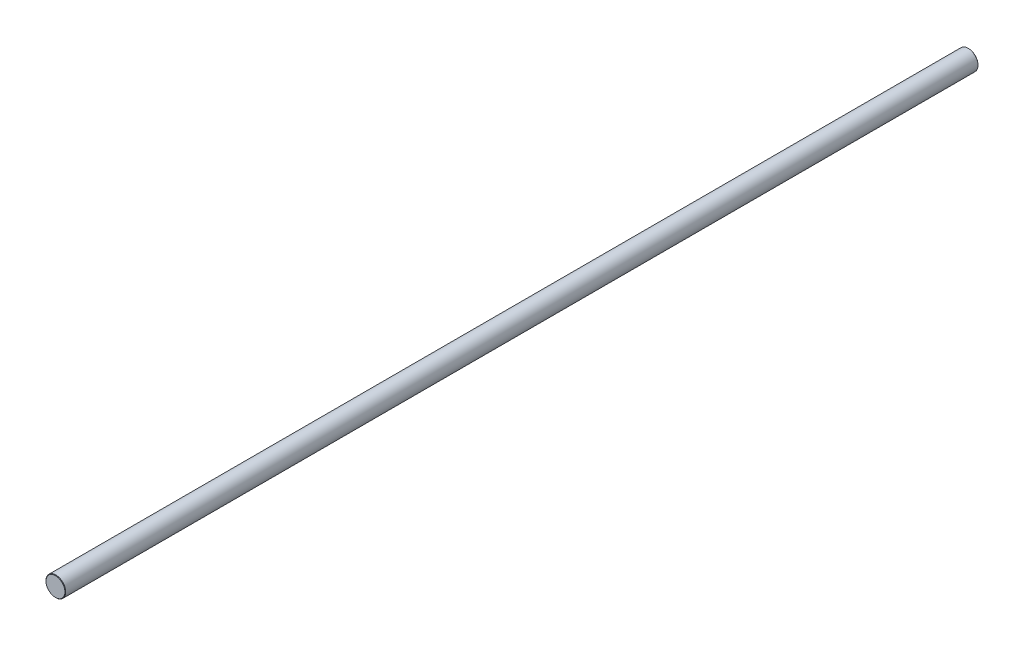
ISO-10303-21;
HEADER;
FILE_DESCRIPTION(('STEP AP214'),'2;1');
FILE_NAME('part.step','',(''),(''),'','','');
FILE_SCHEMA(('AUTOMOTIVE_DESIGN { 1 0 10303 214 1 1 1 1 }'));
ENDSEC;
DATA;
#1=APPLICATION_CONTEXT('core data for automotive mechanical design processes');
#2=APPLICATION_PROTOCOL_DEFINITION('international standard','automotive_design',2000,#1);
#3=PRODUCT_CONTEXT('',#1,'mechanical');
#4=PRODUCT('Part','Part','',(#3));
#5=PRODUCT_RELATED_PRODUCT_CATEGORY('part','',(#4));
#6=PRODUCT_DEFINITION_FORMATION('','',#4);
#7=PRODUCT_DEFINITION_CONTEXT('part definition',#1,'design');
#8=PRODUCT_DEFINITION('design','',#6,#7);
#9=PRODUCT_DEFINITION_SHAPE('','',#8);
#10=(LENGTH_UNIT() NAMED_UNIT(*) SI_UNIT(.MILLI.,.METRE.));
#11=(NAMED_UNIT(*) PLANE_ANGLE_UNIT() SI_UNIT($,.RADIAN.));
#12=(NAMED_UNIT(*) SI_UNIT($,.STERADIAN.) SOLID_ANGLE_UNIT());
#13=UNCERTAINTY_MEASURE_WITH_UNIT(LENGTH_MEASURE(1.E-05),#10,'distance_accuracy_value','');
#14=(GEOMETRIC_REPRESENTATION_CONTEXT(3) GLOBAL_UNCERTAINTY_ASSIGNED_CONTEXT((#13)) GLOBAL_UNIT_ASSIGNED_CONTEXT((#10,
#11,#12)) REPRESENTATION_CONTEXT('',''));
#15=CARTESIAN_POINT('',(0.,0.,0.));
#16=DIRECTION('',(0.,0.,1.));
#17=DIRECTION('',(1.,0.,0.));
#18=AXIS2_PLACEMENT_3D('',#15,#16,#17);
#19=CARTESIAN_POINT('',(0.,0.,185.));
#20=DIRECTION('',(0.,0.,-1.));
#21=DIRECTION('',(-1.,0.,0.));
#22=AXIS2_PLACEMENT_3D('',#19,#20,#21);
#23=CYLINDRICAL_SURFACE('',#22,4.);
#24=CARTESIAN_POINT('',(0.,0.,-184.84));
#25=DIRECTION('',(0.,0.,1.));
#26=DIRECTION('',(1.,0.,0.));
#27=AXIS2_PLACEMENT_3D('',#24,#25,#26);
#28=CIRCLE('',#27,4.);
#29=CARTESIAN_POINT('',(4.,0.,-184.84));
#30=VERTEX_POINT('',#29);
#31=EDGE_CURVE('E50',#30,#30,#28,.T.);
#32=ORIENTED_EDGE('',*,*,#31,.T.);
#33=EDGE_LOOP('',(#32));
#34=FACE_BOUND('',#33,.T.);
#35=CARTESIAN_POINT('',(0.,0.,184.84));
#36=DIRECTION('',(0.,0.,1.));
#37=DIRECTION('',(1.,0.,0.));
#38=AXIS2_PLACEMENT_3D('',#35,#36,#37);
#39=CIRCLE('',#38,4.);
#40=CARTESIAN_POINT('',(4.,0.,184.84));
#41=VERTEX_POINT('',#40);
#42=EDGE_CURVE('E55',#41,#41,#39,.F.);
#43=ORIENTED_EDGE('',*,*,#42,.T.);
#44=EDGE_LOOP('',(#43));
#45=FACE_BOUND('',#44,.T.);
#46=ADVANCED_FACE('F37',(#34,#45),#23,.T.);
#47=CARTESIAN_POINT('',(0.,0.,185.));
#48=DIRECTION('',(0.,0.,1.));
#49=DIRECTION('',(1.,0.,0.));
#50=AXIS2_PLACEMENT_3D('',#47,#48,#49);
#51=PLANE('',#50);
#52=CARTESIAN_POINT('',(0.,0.,185.));
#53=DIRECTION('',(0.,0.,1.));
#54=DIRECTION('',(1.,0.,0.));
#55=AXIS2_PLACEMENT_3D('',#52,#53,#54);
#56=CIRCLE('',#55,3.84000000000007);
#57=CARTESIAN_POINT('',(3.84000000000007,0.,185.));
#58=VERTEX_POINT('',#57);
#59=EDGE_CURVE('E10',#58,#58,#56,.T.);
#60=ORIENTED_EDGE('',*,*,#59,.T.);
#61=EDGE_LOOP('',(#60));
#62=FACE_BOUND('',#61,.T.);
#63=ADVANCED_FACE('F72',(#62),#51,.T.);
#64=CARTESIAN_POINT('',(0.,0.,-185.));
#65=DIRECTION('',(0.,0.,1.));
#66=DIRECTION('',(1.,0.,0.));
#67=AXIS2_PLACEMENT_3D('',#64,#65,#66);
#68=PLANE('',#67);
#69=CARTESIAN_POINT('',(0.,0.,-185.));
#70=DIRECTION('',(0.,0.,1.));
#71=DIRECTION('',(1.,0.,0.));
#72=AXIS2_PLACEMENT_3D('',#69,#70,#71);
#73=CIRCLE('',#72,3.84000000000012);
#74=CARTESIAN_POINT('',(3.84000000000012,0.,-185.));
#75=VERTEX_POINT('',#74);
#76=EDGE_CURVE('E45',#75,#75,#73,.F.);
#77=ORIENTED_EDGE('',*,*,#76,.T.);
#78=EDGE_LOOP('',(#77));
#79=FACE_BOUND('',#78,.T.);
#80=ADVANCED_FACE('F69',(#79),#68,.F.);
#81=CARTESIAN_POINT('',(0.,0.,-184.84));
#82=DIRECTION('',(0.,0.,1.));
#83=DIRECTION('',(1.,0.,0.));
#84=AXIS2_PLACEMENT_3D('',#81,#82,#83);
#85=CONICAL_SURFACE('',#84,4.,0.785398163397438);
#86=ORIENTED_EDGE('',*,*,#76,.F.);
#87=EDGE_LOOP('',(#86));
#88=FACE_BOUND('',#87,.T.);
#89=ORIENTED_EDGE('',*,*,#31,.F.);
#90=EDGE_LOOP('',(#89));
#91=FACE_BOUND('',#90,.T.);
#92=ADVANCED_FACE('F65',(#88,#91),#85,.T.);
#93=CARTESIAN_POINT('',(0.,0.,185.));
#94=DIRECTION('',(0.,0.,-1.));
#95=DIRECTION('',(-1.,0.,0.));
#96=AXIS2_PLACEMENT_3D('',#93,#94,#95);
#97=CONICAL_SURFACE('',#96,3.84000000000007,0.785398163397351);
#98=ORIENTED_EDGE('',*,*,#42,.F.);
#99=EDGE_LOOP('',(#98));
#100=FACE_BOUND('',#99,.T.);
#101=ORIENTED_EDGE('',*,*,#59,.F.);
#102=EDGE_LOOP('',(#101));
#103=FACE_BOUND('',#102,.T.);
#104=ADVANCED_FACE('F39',(#100,#103),#97,.T.);
#105=CLOSED_SHELL('',(#46,#63,#80,#92,#104));
#106=MANIFOLD_SOLID_BREP('B2',#105);
#107=ADVANCED_BREP_SHAPE_REPRESENTATION('',(#18,#106),#14);
#108=SHAPE_DEFINITION_REPRESENTATION(#9,#107);
ENDSEC;
END-ISO-10303-21;
